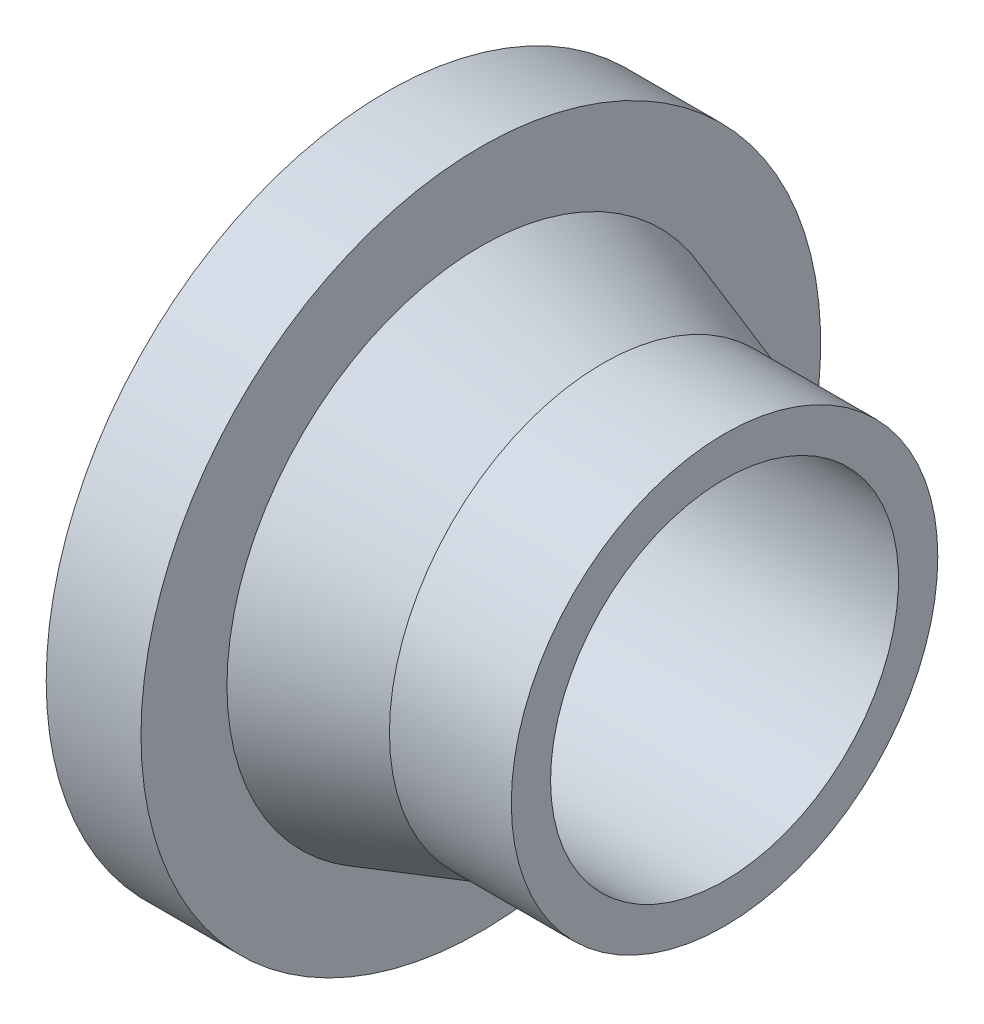
ISO-10303-21;
HEADER;
FILE_DESCRIPTION(('STEP AP214'),'2;1');
FILE_NAME('part.step','',(''),(''),'','','');
FILE_SCHEMA(('AUTOMOTIVE_DESIGN { 1 0 10303 214 1 1 1 1 }'));
ENDSEC;
DATA;
#1=APPLICATION_CONTEXT('core data for automotive mechanical design processes');
#2=APPLICATION_PROTOCOL_DEFINITION('international standard','automotive_design',2000,#1);
#3=PRODUCT_CONTEXT('',#1,'mechanical');
#4=PRODUCT('Part','Part','',(#3));
#5=PRODUCT_RELATED_PRODUCT_CATEGORY('part','',(#4));
#6=PRODUCT_DEFINITION_FORMATION('','',#4);
#7=PRODUCT_DEFINITION_CONTEXT('part definition',#1,'design');
#8=PRODUCT_DEFINITION('design','',#6,#7);
#9=PRODUCT_DEFINITION_SHAPE('','',#8);
#10=(LENGTH_UNIT() NAMED_UNIT(*) SI_UNIT(.MILLI.,.METRE.));
#11=(NAMED_UNIT(*) PLANE_ANGLE_UNIT() SI_UNIT($,.RADIAN.));
#12=(NAMED_UNIT(*) SI_UNIT($,.STERADIAN.) SOLID_ANGLE_UNIT());
#13=UNCERTAINTY_MEASURE_WITH_UNIT(LENGTH_MEASURE(1.E-05),#10,'distance_accuracy_value','');
#14=(GEOMETRIC_REPRESENTATION_CONTEXT(3) GLOBAL_UNCERTAINTY_ASSIGNED_CONTEXT((#13)) GLOBAL_UNIT_ASSIGNED_CONTEXT((#10,
#11,#12)) REPRESENTATION_CONTEXT('',''));
#15=CARTESIAN_POINT('',(0.,0.,0.));
#16=DIRECTION('',(0.,0.,1.));
#17=DIRECTION('',(1.,0.,0.));
#18=AXIS2_PLACEMENT_3D('',#15,#16,#17);
#19=CARTESIAN_POINT('',(-18.,0.,0.));
#20=DIRECTION('',(-1.,0.,0.));
#21=DIRECTION('',(0.,0.,1.));
#22=AXIS2_PLACEMENT_3D('',#19,#20,#21);
#23=CONICAL_SURFACE('',#22,31.5,0.321750554396642);
#24=CARTESIAN_POINT('',(-36.,0.,0.));
#25=DIRECTION('',(-1.,0.,0.));
#26=DIRECTION('',(0.,0.,1.));
#27=AXIS2_PLACEMENT_3D('',#24,#25,#26);
#28=CIRCLE('',#27,37.5);
#29=CARTESIAN_POINT('',(-36.,0.,37.5));
#30=VERTEX_POINT('',#29);
#31=EDGE_CURVE('E16',#30,#30,#28,.T.);
#32=ORIENTED_EDGE('',*,*,#31,.F.);
#33=EDGE_LOOP('',(#32));
#34=FACE_BOUND('',#33,.T.);
#35=CARTESIAN_POINT('',(-18.,0.,0.));
#36=DIRECTION('',(-1.,0.,0.));
#37=DIRECTION('',(0.,1.,0.));
#38=AXIS2_PLACEMENT_3D('',#35,#36,#37);
#39=CIRCLE('',#38,31.5);
#40=CARTESIAN_POINT('',(-18.,31.5,0.));
#41=VERTEX_POINT('',#40);
#42=EDGE_CURVE('E28',#41,#41,#39,.F.);
#43=ORIENTED_EDGE('',*,*,#42,.F.);
#44=EDGE_LOOP('',(#43));
#45=FACE_BOUND('',#44,.T.);
#46=ADVANCED_FACE('F13',(#34,#45),#23,.T.);
#47=CARTESIAN_POINT('',(-36.,50.2,50.8024021082552));
#48=DIRECTION('',(1.,0.,0.));
#49=DIRECTION('',(0.,-1.,0.));
#50=AXIS2_PLACEMENT_3D('',#47,#48,#49);
#51=PLANE('',#50);
#52=ORIENTED_EDGE('',*,*,#31,.T.);
#53=EDGE_LOOP('',(#52));
#54=FACE_BOUND('',#53,.T.);
#55=CARTESIAN_POINT('',(-36.,0.,0.));
#56=DIRECTION('',(-1.,0.,0.));
#57=DIRECTION('',(0.,0.,1.));
#58=AXIS2_PLACEMENT_3D('',#55,#56,#57);
#59=CIRCLE('',#58,50.2);
#60=CARTESIAN_POINT('',(-36.,0.,50.2));
#61=VERTEX_POINT('',#60);
#62=EDGE_CURVE('E34',#61,#61,#59,.T.);
#63=ORIENTED_EDGE('',*,*,#62,.F.);
#64=EDGE_LOOP('',(#63));
#65=FACE_BOUND('',#64,.T.);
#66=ADVANCED_FACE('F44',(#54,#65),#51,.T.);
#67=CARTESIAN_POINT('',(-18.,0.,0.));
#68=DIRECTION('',(-1.,0.,0.));
#69=DIRECTION('',(0.,0.,1.));
#70=AXIS2_PLACEMENT_3D('',#67,#68,#69);
#71=CYLINDRICAL_SURFACE('',#70,31.5);
#72=ORIENTED_EDGE('',*,*,#42,.T.);
#73=EDGE_LOOP('',(#72));
#74=FACE_BOUND('',#73,.T.);
#75=CARTESIAN_POINT('',(0.,0.,0.));
#76=DIRECTION('',(-1.,0.,0.));
#77=DIRECTION('',(0.,0.,1.));
#78=AXIS2_PLACEMENT_3D('',#75,#76,#77);
#79=CIRCLE('',#78,31.5);
#80=CARTESIAN_POINT('',(0.,0.,31.5));
#81=VERTEX_POINT('',#80);
#82=EDGE_CURVE('E32',#81,#81,#79,.F.);
#83=ORIENTED_EDGE('',*,*,#82,.F.);
#84=EDGE_LOOP('',(#83));
#85=FACE_BOUND('',#84,.T.);
#86=ADVANCED_FACE('F53',(#74,#85),#71,.T.);
#87=CARTESIAN_POINT('',(-50.,0.,0.));
#88=DIRECTION('',(-1.,0.,0.));
#89=DIRECTION('',(0.,0.,1.));
#90=AXIS2_PLACEMENT_3D('',#87,#88,#89);
#91=CYLINDRICAL_SURFACE('',#90,50.2);
#92=CARTESIAN_POINT('',(-50.,0.,0.));
#93=DIRECTION('',(-1.,0.,0.));
#94=DIRECTION('',(0.,0.,1.));
#95=AXIS2_PLACEMENT_3D('',#92,#93,#94);
#96=CIRCLE('',#95,50.2);
#97=CARTESIAN_POINT('',(-50.,0.,50.2));
#98=VERTEX_POINT('',#97);
#99=EDGE_CURVE('E25',#98,#98,#96,.T.);
#100=ORIENTED_EDGE('',*,*,#99,.F.);
#101=EDGE_LOOP('',(#100));
#102=FACE_BOUND('',#101,.T.);
#103=ORIENTED_EDGE('',*,*,#62,.T.);
#104=EDGE_LOOP('',(#103));
#105=FACE_BOUND('',#104,.T.);
#106=ADVANCED_FACE('F68',(#102,#105),#91,.T.);
#107=CARTESIAN_POINT('',(0.,31.5,31.8780010540613));
#108=DIRECTION('',(1.,0.,0.));
#109=DIRECTION('',(0.,-1.,0.));
#110=AXIS2_PLACEMENT_3D('',#107,#108,#109);
#111=PLANE('',#110);
#112=CARTESIAN_POINT('',(0.,0.,0.));
#113=DIRECTION('',(-1.,0.,0.));
#114=DIRECTION('',(0.,0.,1.));
#115=AXIS2_PLACEMENT_3D('',#112,#113,#114);
#116=CIRCLE('',#115,25.7);
#117=CARTESIAN_POINT('',(0.,0.,25.7));
#118=VERTEX_POINT('',#117);
#119=EDGE_CURVE('E20',#118,#118,#116,.F.);
#120=ORIENTED_EDGE('',*,*,#119,.F.);
#121=EDGE_LOOP('',(#120));
#122=FACE_BOUND('',#121,.T.);
#123=ORIENTED_EDGE('',*,*,#82,.T.);
#124=EDGE_LOOP('',(#123));
#125=FACE_BOUND('',#124,.T.);
#126=ADVANCED_FACE('F62',(#122,#125),#111,.T.);
#127=CARTESIAN_POINT('',(-50.,-50.2,50.8024021082552));
#128=DIRECTION('',(-1.,0.,0.));
#129=DIRECTION('',(0.,1.,0.));
#130=AXIS2_PLACEMENT_3D('',#127,#128,#129);
#131=PLANE('',#130);
#132=CARTESIAN_POINT('',(-50.,0.,0.));
#133=DIRECTION('',(-1.,0.,0.));
#134=DIRECTION('',(0.,0.,1.));
#135=AXIS2_PLACEMENT_3D('',#132,#133,#134);
#136=CIRCLE('',#135,25.7);
#137=CARTESIAN_POINT('',(-50.,0.,25.7));
#138=VERTEX_POINT('',#137);
#139=EDGE_CURVE('E8',#138,#138,#136,.T.);
#140=ORIENTED_EDGE('',*,*,#139,.F.);
#141=EDGE_LOOP('',(#140));
#142=FACE_BOUND('',#141,.T.);
#143=ORIENTED_EDGE('',*,*,#99,.T.);
#144=EDGE_LOOP('',(#143));
#145=FACE_BOUND('',#144,.T.);
#146=ADVANCED_FACE('F56',(#142,#145),#131,.T.);
#147=CARTESIAN_POINT('',(0.,0.,0.));
#148=DIRECTION('',(-1.,0.,0.));
#149=DIRECTION('',(0.,0.,1.));
#150=AXIS2_PLACEMENT_3D('',#147,#148,#149);
#151=CYLINDRICAL_SURFACE('',#150,25.7);
#152=ORIENTED_EDGE('',*,*,#119,.T.);
#153=EDGE_LOOP('',(#152));
#154=FACE_BOUND('',#153,.T.);
#155=ORIENTED_EDGE('',*,*,#139,.T.);
#156=EDGE_LOOP('',(#155));
#157=FACE_BOUND('',#156,.T.);
#158=ADVANCED_FACE('F54',(#154,#157),#151,.F.);
#159=CLOSED_SHELL('',(#46,#66,#86,#106,#126,#146,#158));
#160=MANIFOLD_SOLID_BREP('B1',#159);
#161=ADVANCED_BREP_SHAPE_REPRESENTATION('',(#18,#160),#14);
#162=SHAPE_DEFINITION_REPRESENTATION(#9,#161);
ENDSEC;
END-ISO-10303-21;
